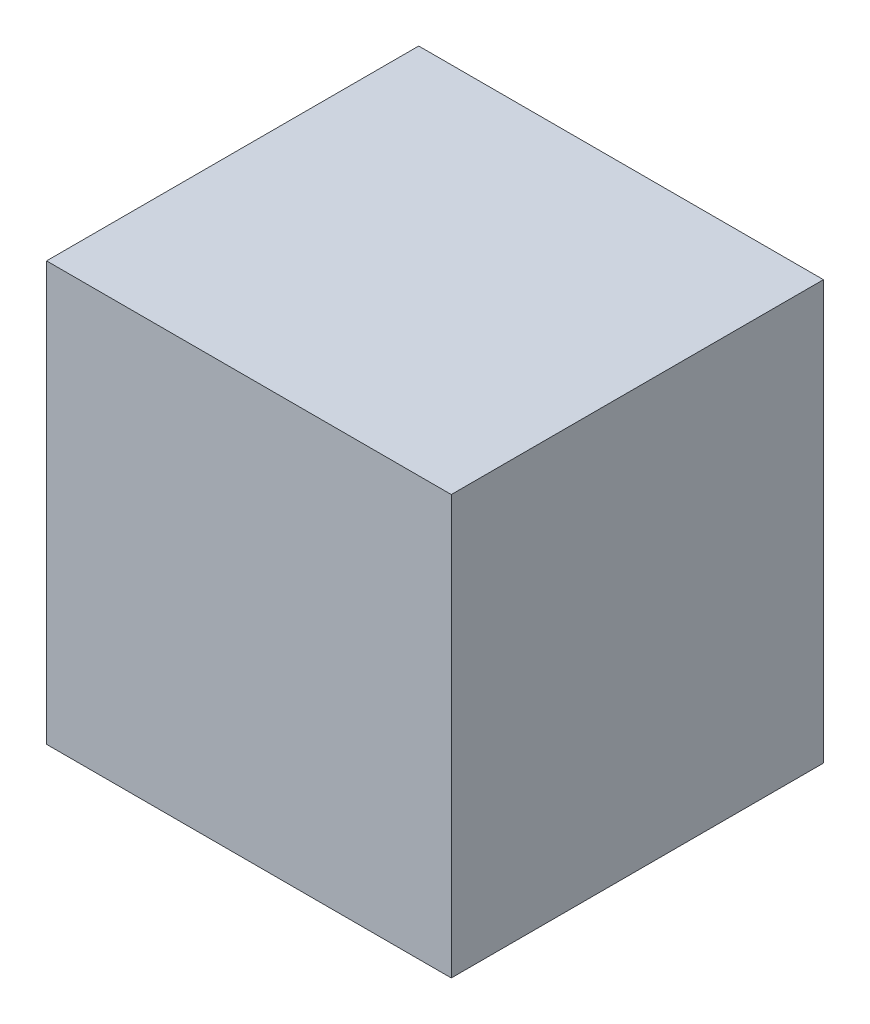
ISO-10303-21;
HEADER;
FILE_DESCRIPTION(('STEP AP214'),'2;1');
FILE_NAME('part.step','',(''),(''),'','','');
FILE_SCHEMA(('AUTOMOTIVE_DESIGN { 1 0 10303 214 1 1 1 1 }'));
ENDSEC;
DATA;
#1=APPLICATION_CONTEXT('core data for automotive mechanical design processes');
#2=APPLICATION_PROTOCOL_DEFINITION('international standard','automotive_design',2000,#1);
#3=PRODUCT_CONTEXT('',#1,'mechanical');
#4=PRODUCT('Part','Part','',(#3));
#5=PRODUCT_RELATED_PRODUCT_CATEGORY('part','',(#4));
#6=PRODUCT_DEFINITION_FORMATION('','',#4);
#7=PRODUCT_DEFINITION_CONTEXT('part definition',#1,'design');
#8=PRODUCT_DEFINITION('design','',#6,#7);
#9=PRODUCT_DEFINITION_SHAPE('','',#8);
#10=(LENGTH_UNIT() NAMED_UNIT(*) SI_UNIT(.MILLI.,.METRE.));
#11=(NAMED_UNIT(*) PLANE_ANGLE_UNIT() SI_UNIT($,.RADIAN.));
#12=(NAMED_UNIT(*) SI_UNIT($,.STERADIAN.) SOLID_ANGLE_UNIT());
#13=UNCERTAINTY_MEASURE_WITH_UNIT(LENGTH_MEASURE(1.E-05),#10,'distance_accuracy_value','');
#14=(GEOMETRIC_REPRESENTATION_CONTEXT(3) GLOBAL_UNCERTAINTY_ASSIGNED_CONTEXT((#13)) GLOBAL_UNIT_ASSIGNED_CONTEXT((#10,
#11,#12)) REPRESENTATION_CONTEXT('',''));
#15=CARTESIAN_POINT('',(0.,0.,0.));
#16=DIRECTION('',(0.,0.,1.));
#17=DIRECTION('',(1.,0.,0.));
#18=AXIS2_PLACEMENT_3D('',#15,#16,#17);
#19=CARTESIAN_POINT('',(-34.5699896684918,440.424858976713,400.));
#20=DIRECTION('',(1.,0.,0.));
#21=DIRECTION('',(0.,0.,-1.));
#22=AXIS2_PLACEMENT_3D('',#19,#20,#21);
#23=PLANE('',#22);
#24=DIRECTION('',(0.,-1.,0.));
#25=VECTOR('',#24,1.);
#26=CARTESIAN_POINT('',(-34.5699896684918,440.424858976713,0.));
#27=LINE('',#26,#25);
#28=CARTESIAN_POINT('',(-34.5699896684918,440.424858976713,0.));
#29=VERTEX_POINT('',#28);
#30=CARTESIAN_POINT('',(-34.5699896684918,-9.5751410232873,0.));
#31=VERTEX_POINT('',#30);
#32=EDGE_CURVE('E98',#29,#31,#27,.T.);
#33=ORIENTED_EDGE('',*,*,#32,.T.);
#34=DIRECTION('',(0.,0.,-1.));
#35=VECTOR('',#34,1.);
#36=CARTESIAN_POINT('',(-34.5699896684918,-9.5751410232873,400.));
#37=LINE('',#36,#35);
#38=CARTESIAN_POINT('',(-34.5699896684918,-9.5751410232873,400.));
#39=VERTEX_POINT('',#38);
#40=EDGE_CURVE('E11',#39,#31,#37,.T.);
#41=ORIENTED_EDGE('',*,*,#40,.F.);
#42=DIRECTION('',(0.,-1.,0.));
#43=VECTOR('',#42,1.);
#44=CARTESIAN_POINT('',(-34.5699896684918,440.424858976713,400.));
#45=LINE('',#44,#43);
#46=CARTESIAN_POINT('',(-34.5699896684918,440.424858976713,400.));
#47=VERTEX_POINT('',#46);
#48=EDGE_CURVE('E86',#47,#39,#45,.T.);
#49=ORIENTED_EDGE('',*,*,#48,.F.);
#50=DIRECTION('',(0.,0.,-1.));
#51=VECTOR('',#50,1.);
#52=CARTESIAN_POINT('',(-34.5699896684918,440.424858976713,400.));
#53=LINE('',#52,#51);
#54=EDGE_CURVE('E94',#47,#29,#53,.T.);
#55=ORIENTED_EDGE('',*,*,#54,.T.);
#56=EDGE_LOOP('',(#33,#41,#49,#55));
#57=FACE_BOUND('',#56,.T.);
#58=ADVANCED_FACE('F35',(#57),#23,.F.);
#59=CARTESIAN_POINT('',(-34.5699896684918,-9.5751410232873,400.));
#60=DIRECTION('',(0.,1.,0.));
#61=DIRECTION('',(0.,0.,1.));
#62=AXIS2_PLACEMENT_3D('',#59,#60,#61);
#63=PLANE('',#62);
#64=DIRECTION('',(1.,0.,0.));
#65=VECTOR('',#64,1.);
#66=CARTESIAN_POINT('',(-34.5699896684918,-9.5751410232873,0.));
#67=LINE('',#66,#65);
#68=CARTESIAN_POINT('',(400.430010331508,-9.5751410232873,0.));
#69=VERTEX_POINT('',#68);
#70=EDGE_CURVE('E90',#31,#69,#67,.T.);
#71=ORIENTED_EDGE('',*,*,#70,.T.);
#72=DIRECTION('',(0.,0.,-1.));
#73=VECTOR('',#72,1.);
#74=CARTESIAN_POINT('',(400.430010331508,-9.5751410232873,400.));
#75=LINE('',#74,#73);
#76=CARTESIAN_POINT('',(400.430010331508,-9.5751410232873,400.));
#77=VERTEX_POINT('',#76);
#78=EDGE_CURVE('E43',#77,#69,#75,.T.);
#79=ORIENTED_EDGE('',*,*,#78,.F.);
#80=DIRECTION('',(1.,0.,0.));
#81=VECTOR('',#80,1.);
#82=CARTESIAN_POINT('',(-34.5699896684918,-9.5751410232873,400.));
#83=LINE('',#82,#81);
#84=EDGE_CURVE('E81',#39,#77,#83,.T.);
#85=ORIENTED_EDGE('',*,*,#84,.F.);
#86=ORIENTED_EDGE('',*,*,#40,.T.);
#87=EDGE_LOOP('',(#71,#79,#85,#86));
#88=FACE_BOUND('',#87,.T.);
#89=ADVANCED_FACE('F89',(#88),#63,.F.);
#90=CARTESIAN_POINT('',(400.430010331508,-9.5751410232873,400.));
#91=DIRECTION('',(-1.,0.,0.));
#92=DIRECTION('',(0.,0.,1.));
#93=AXIS2_PLACEMENT_3D('',#90,#91,#92);
#94=PLANE('',#93);
#95=DIRECTION('',(0.,1.,0.));
#96=VECTOR('',#95,1.);
#97=CARTESIAN_POINT('',(400.430010331508,-9.5751410232873,0.));
#98=LINE('',#97,#96);
#99=CARTESIAN_POINT('',(400.430010331508,440.424858976713,0.));
#100=VERTEX_POINT('',#99);
#101=EDGE_CURVE('E68',#69,#100,#98,.T.);
#102=ORIENTED_EDGE('',*,*,#101,.T.);
#103=DIRECTION('',(0.,0.,-1.));
#104=VECTOR('',#103,1.);
#105=CARTESIAN_POINT('',(400.430010331508,440.424858976713,400.));
#106=LINE('',#105,#104);
#107=CARTESIAN_POINT('',(400.430010331508,440.424858976713,400.));
#108=VERTEX_POINT('',#107);
#109=EDGE_CURVE('E91',#108,#100,#106,.T.);
#110=ORIENTED_EDGE('',*,*,#109,.F.);
#111=DIRECTION('',(0.,1.,0.));
#112=VECTOR('',#111,1.);
#113=CARTESIAN_POINT('',(400.430010331508,-9.5751410232873,400.));
#114=LINE('',#113,#112);
#115=EDGE_CURVE('E84',#77,#108,#114,.T.);
#116=ORIENTED_EDGE('',*,*,#115,.F.);
#117=ORIENTED_EDGE('',*,*,#78,.T.);
#118=EDGE_LOOP('',(#102,#110,#116,#117));
#119=FACE_BOUND('',#118,.T.);
#120=ADVANCED_FACE('F92',(#119),#94,.F.);
#121=CARTESIAN_POINT('',(400.430010331508,440.424858976713,400.));
#122=DIRECTION('',(0.,-1.,0.));
#123=DIRECTION('',(0.,0.,-1.));
#124=AXIS2_PLACEMENT_3D('',#121,#122,#123);
#125=PLANE('',#124);
#126=DIRECTION('',(-1.,0.,0.));
#127=VECTOR('',#126,1.);
#128=CARTESIAN_POINT('',(400.430010331508,440.424858976713,0.));
#129=LINE('',#128,#127);
#130=EDGE_CURVE('E74',#100,#29,#129,.T.);
#131=ORIENTED_EDGE('',*,*,#130,.T.);
#132=ORIENTED_EDGE('',*,*,#54,.F.);
#133=DIRECTION('',(-1.,0.,0.));
#134=VECTOR('',#133,1.);
#135=CARTESIAN_POINT('',(400.430010331508,440.424858976713,400.));
#136=LINE('',#135,#134);
#137=EDGE_CURVE('E51',#108,#47,#136,.T.);
#138=ORIENTED_EDGE('',*,*,#137,.F.);
#139=ORIENTED_EDGE('',*,*,#109,.T.);
#140=EDGE_LOOP('',(#131,#132,#138,#139));
#141=FACE_BOUND('',#140,.T.);
#142=ADVANCED_FACE('F105',(#141),#125,.F.);
#143=CARTESIAN_POINT('',(0.,0.,400.));
#144=DIRECTION('',(0.,0.,1.));
#145=DIRECTION('',(1.,0.,0.));
#146=AXIS2_PLACEMENT_3D('',#143,#144,#145);
#147=PLANE('',#146);
#148=ORIENTED_EDGE('',*,*,#48,.T.);
#149=ORIENTED_EDGE('',*,*,#84,.T.);
#150=ORIENTED_EDGE('',*,*,#115,.T.);
#151=ORIENTED_EDGE('',*,*,#137,.T.);
#152=EDGE_LOOP('',(#148,#149,#150,#151));
#153=FACE_BOUND('',#152,.T.);
#154=ADVANCED_FACE('F82',(#153),#147,.T.);
#155=CARTESIAN_POINT('',(0.,0.,0.));
#156=DIRECTION('',(0.,0.,1.));
#157=DIRECTION('',(1.,0.,0.));
#158=AXIS2_PLACEMENT_3D('',#155,#156,#157);
#159=PLANE('',#158);
#160=ORIENTED_EDGE('',*,*,#32,.F.);
#161=ORIENTED_EDGE('',*,*,#130,.F.);
#162=ORIENTED_EDGE('',*,*,#101,.F.);
#163=ORIENTED_EDGE('',*,*,#70,.F.);
#164=EDGE_LOOP('',(#160,#161,#162,#163));
#165=FACE_BOUND('',#164,.T.);
#166=ADVANCED_FACE('F108',(#165),#159,.F.);
#167=CLOSED_SHELL('',(#58,#89,#120,#142,#154,#166));
#168=MANIFOLD_SOLID_BREP('B2',#167);
#169=ADVANCED_BREP_SHAPE_REPRESENTATION('',(#18,#168),#14);
#170=SHAPE_DEFINITION_REPRESENTATION(#9,#169);
ENDSEC;
END-ISO-10303-21;
